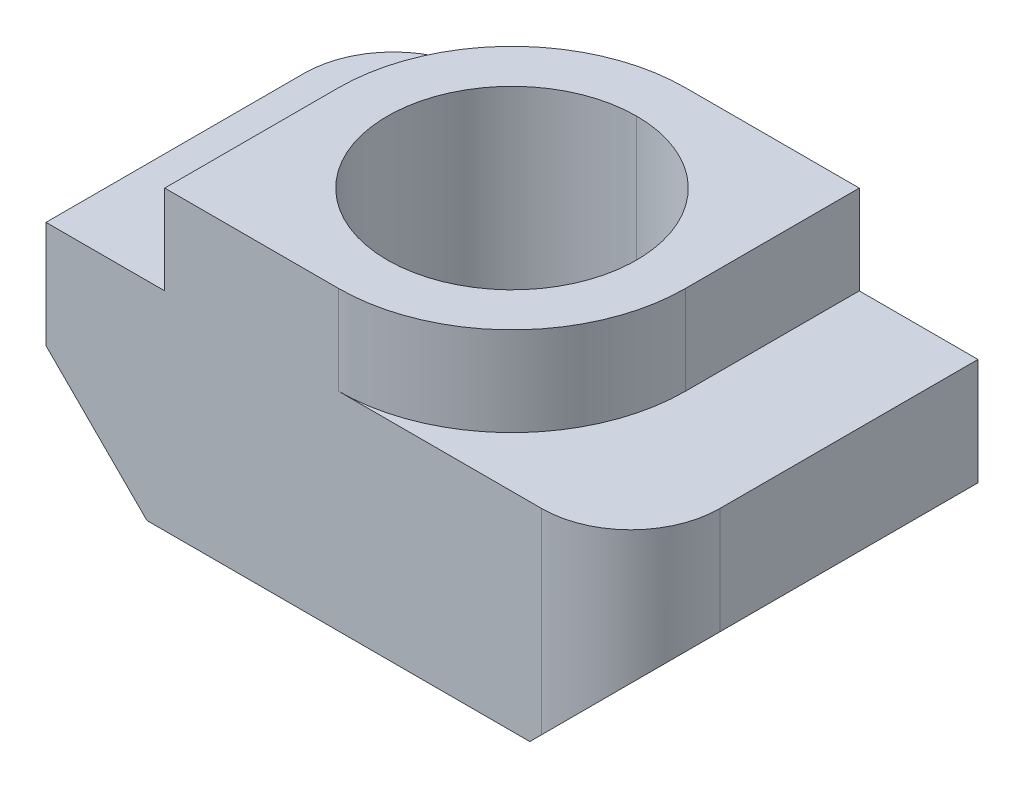
ISO-10303-21;
HEADER;
FILE_DESCRIPTION(('STEP AP214'),'2;1');
FILE_NAME('part.step','',(''),(''),'','','');
FILE_SCHEMA(('AUTOMOTIVE_DESIGN { 1 0 10303 214 1 1 1 1 }'));
ENDSEC;
DATA;
#1=APPLICATION_CONTEXT('core data for automotive mechanical design processes');
#2=APPLICATION_PROTOCOL_DEFINITION('international standard','automotive_design',2000,#1);
#3=PRODUCT_CONTEXT('',#1,'mechanical');
#4=PRODUCT('Part','Part','',(#3));
#5=PRODUCT_RELATED_PRODUCT_CATEGORY('part','',(#4));
#6=PRODUCT_DEFINITION_FORMATION('','',#4);
#7=PRODUCT_DEFINITION_CONTEXT('part definition',#1,'design');
#8=PRODUCT_DEFINITION('design','',#6,#7);
#9=PRODUCT_DEFINITION_SHAPE('','',#8);
#10=(LENGTH_UNIT() NAMED_UNIT(*) SI_UNIT(.MILLI.,.METRE.));
#11=(NAMED_UNIT(*) PLANE_ANGLE_UNIT() SI_UNIT($,.RADIAN.));
#12=(NAMED_UNIT(*) SI_UNIT($,.STERADIAN.) SOLID_ANGLE_UNIT());
#13=UNCERTAINTY_MEASURE_WITH_UNIT(LENGTH_MEASURE(1.E-05),#10,'distance_accuracy_value','');
#14=(GEOMETRIC_REPRESENTATION_CONTEXT(3) GLOBAL_UNCERTAINTY_ASSIGNED_CONTEXT((#13)) GLOBAL_UNIT_ASSIGNED_CONTEXT((#10,
#11,#12)) REPRESENTATION_CONTEXT('',''));
#15=CARTESIAN_POINT('',(0.,0.,0.));
#16=DIRECTION('',(0.,0.,1.));
#17=DIRECTION('',(1.,0.,0.));
#18=AXIS2_PLACEMENT_3D('',#15,#16,#17);
#19=CARTESIAN_POINT('',(3.425,3.5,1.425));
#20=DIRECTION('',(0.,-1.,0.));
#21=DIRECTION('',(0.,0.,-1.));
#22=AXIS2_PLACEMENT_3D('',#19,#20,#21);
#23=CYLINDRICAL_SURFACE('',#22,1.5);
#24=CARTESIAN_POINT('',(3.425,3.5,1.425));
#25=DIRECTION('',(0.,1.,0.));
#26=DIRECTION('',(0.,0.,-1.));
#27=AXIS2_PLACEMENT_3D('',#24,#25,#26);
#28=CIRCLE('',#27,1.5);
#29=CARTESIAN_POINT('',(3.425,3.5,2.925));
#30=VERTEX_POINT('',#29);
#31=CARTESIAN_POINT('',(4.925,3.5,1.425));
#32=VERTEX_POINT('',#31);
#33=EDGE_CURVE('E216',#30,#32,#28,.T.);
#34=ORIENTED_EDGE('',*,*,#33,.F.);
#35=DIRECTION('',(0.,1.,0.));
#36=VECTOR('',#35,1.);
#37=CARTESIAN_POINT('',(3.425,3.5,2.925));
#38=LINE('',#37,#36);
#39=CARTESIAN_POINT('',(3.425,0.200000000000006,2.925));
#40=VERTEX_POINT('',#39);
#41=EDGE_CURVE('E234',#40,#30,#38,.T.);
#42=ORIENTED_EDGE('',*,*,#41,.F.);
#43=CARTESIAN_POINT('',(4.925,1.7,1.425));
#44=CARTESIAN_POINT('',(4.925,1.7,2.30367965644035));
#45=CARTESIAN_POINT('',(4.30367965644036,1.07867965644036,2.925));
#46=CARTESIAN_POINT('',(3.425,0.200000000000006,2.925));
#47=(BOUNDED_CURVE() B_SPLINE_CURVE(3,(#43,#44,#45,#46),.UNSPECIFIED.,.F.,
.F.) B_SPLINE_CURVE_WITH_KNOTS((4,4),(3.1415926535898,4.71238898038469),
.UNSPECIFIED.) CURVE() GEOMETRIC_REPRESENTATION_ITEM() RATIONAL_B_SPLINE_CURVE((1.,
0.804737854124365,0.804737854124365,1.)) REPRESENTATION_ITEM(''));
#48=CARTESIAN_POINT('',(4.925,1.7,1.425));
#49=VERTEX_POINT('',#48);
#50=EDGE_CURVE('E11',#49,#40,#47,.T.);
#51=ORIENTED_EDGE('',*,*,#50,.F.);
#52=DIRECTION('',(0.,-1.,0.));
#53=VECTOR('',#52,1.);
#54=CARTESIAN_POINT('',(4.925,3.5,1.425));
#55=LINE('',#54,#53);
#56=EDGE_CURVE('E253',#32,#49,#55,.T.);
#57=ORIENTED_EDGE('',*,*,#56,.F.);
#58=EDGE_LOOP('',(#34,#42,#51,#57));
#59=FACE_BOUND('',#58,.T.);
#60=ADVANCED_FACE('F17',(#59),#23,.T.);
#61=CARTESIAN_POINT('',(-3.425,3.5,-1.425));
#62=DIRECTION('',(0.,-1.,0.));
#63=DIRECTION('',(0.,0.,-1.));
#64=AXIS2_PLACEMENT_3D('',#61,#62,#63);
#65=CYLINDRICAL_SURFACE('',#64,1.5);
#66=CARTESIAN_POINT('',(-3.425,3.5,-1.425));
#67=DIRECTION('',(0.,1.,0.));
#68=DIRECTION('',(0.,0.,-1.));
#69=AXIS2_PLACEMENT_3D('',#66,#67,#68);
#70=CIRCLE('',#69,1.5);
#71=CARTESIAN_POINT('',(-3.425,3.5,-2.925));
#72=VERTEX_POINT('',#71);
#73=CARTESIAN_POINT('',(-4.925,3.5,-1.425));
#74=VERTEX_POINT('',#73);
#75=EDGE_CURVE('E194',#72,#74,#70,.T.);
#76=ORIENTED_EDGE('',*,*,#75,.F.);
#77=DIRECTION('',(0.,1.,0.));
#78=VECTOR('',#77,1.);
#79=CARTESIAN_POINT('',(-3.425,3.5,-2.925));
#80=LINE('',#79,#78);
#81=CARTESIAN_POINT('',(-3.425,0.200000000000004,-2.925));
#82=VERTEX_POINT('',#81);
#83=EDGE_CURVE('E260',#82,#72,#80,.T.);
#84=ORIENTED_EDGE('',*,*,#83,.F.);
#85=CARTESIAN_POINT('',(-4.925,1.7,-1.425));
#86=CARTESIAN_POINT('',(-4.925,1.7,-2.30367965644035));
#87=CARTESIAN_POINT('',(-4.30367965644036,1.07867965644036,-2.925));
#88=CARTESIAN_POINT('',(-3.425,0.200000000000004,-2.925));
#89=(BOUNDED_CURVE() B_SPLINE_CURVE(3,(#85,#86,#87,#88),.UNSPECIFIED.,.F.,
.F.) B_SPLINE_CURVE_WITH_KNOTS((4,4),(3.1415926535898,4.71238898038469),
.UNSPECIFIED.) CURVE() GEOMETRIC_REPRESENTATION_ITEM() RATIONAL_B_SPLINE_CURVE((1.,
0.804737854124365,0.804737854124365,1.)) REPRESENTATION_ITEM(''));
#90=CARTESIAN_POINT('',(-4.925,1.7,-1.425));
#91=VERTEX_POINT('',#90);
#92=EDGE_CURVE('E28',#91,#82,#89,.T.);
#93=ORIENTED_EDGE('',*,*,#92,.F.);
#94=DIRECTION('',(0.,-1.,0.));
#95=VECTOR('',#94,1.);
#96=CARTESIAN_POINT('',(-4.925,3.5,-1.425));
#97=LINE('',#96,#95);
#98=EDGE_CURVE('E227',#74,#91,#97,.T.);
#99=ORIENTED_EDGE('',*,*,#98,.F.);
#100=EDGE_LOOP('',(#76,#84,#93,#99));
#101=FACE_BOUND('',#100,.T.);
#102=ADVANCED_FACE('F380',(#101),#65,.T.);
#103=CARTESIAN_POINT('',(4.925,1.7,-2.925));
#104=DIRECTION('',(0.707106781186546,-0.707106781186549,0.));
#105=DIRECTION('',(0.,0.,-1.));
#106=AXIS2_PLACEMENT_3D('',#103,#104,#105);
#107=PLANE('',#106);
#108=DIRECTION('',(0.,0.,-1.));
#109=VECTOR('',#108,1.);
#110=CARTESIAN_POINT('',(4.925,1.7,-2.925));
#111=LINE('',#110,#109);
#112=CARTESIAN_POINT('',(4.925,1.7,-2.925));
#113=VERTEX_POINT('',#112);
#114=EDGE_CURVE('E259',#49,#113,#111,.T.);
#115=ORIENTED_EDGE('',*,*,#114,.F.);
#116=ORIENTED_EDGE('',*,*,#50,.T.);
#117=DIRECTION('',(0.707106781186549,0.707106781186546,0.));
#118=VECTOR('',#117,1.);
#119=CARTESIAN_POINT('',(4.925,1.7,2.925));
#120=LINE('',#119,#118);
#121=CARTESIAN_POINT('',(3.225,0.,2.925));
#122=VERTEX_POINT('',#121);
#123=EDGE_CURVE('E177',#122,#40,#120,.T.);
#124=ORIENTED_EDGE('',*,*,#123,.F.);
#125=DIRECTION('',(0.,0.,1.));
#126=VECTOR('',#125,1.);
#127=CARTESIAN_POINT('',(3.225,0.,2.925));
#128=LINE('',#127,#126);
#129=CARTESIAN_POINT('',(3.225,0.,-2.925));
#130=VERTEX_POINT('',#129);
#131=EDGE_CURVE('E286',#130,#122,#128,.T.);
#132=ORIENTED_EDGE('',*,*,#131,.F.);
#133=DIRECTION('',(-0.707106781186549,-0.707106781186546,0.));
#134=VECTOR('',#133,1.);
#135=CARTESIAN_POINT('',(4.925,1.7,-2.925));
#136=LINE('',#135,#134);
#137=EDGE_CURVE('E271',#113,#130,#136,.T.);
#138=ORIENTED_EDGE('',*,*,#137,.F.);
#139=EDGE_LOOP('',(#115,#116,#124,#132,#138));
#140=FACE_BOUND('',#139,.T.);
#141=ADVANCED_FACE('F359',(#140),#107,.T.);
#142=CARTESIAN_POINT('',(-4.925,1.7,-2.925));
#143=DIRECTION('',(-0.707106781186546,-0.707106781186549,0.));
#144=DIRECTION('',(-0.707106781186549,0.707106781186546,0.));
#145=AXIS2_PLACEMENT_3D('',#142,#143,#144);
#146=PLANE('',#145);
#147=DIRECTION('',(0.,0.,1.));
#148=VECTOR('',#147,1.);
#149=CARTESIAN_POINT('',(-4.925,1.7,2.925));
#150=LINE('',#149,#148);
#151=CARTESIAN_POINT('',(-4.925,1.7,2.925));
#152=VERTEX_POINT('',#151);
#153=EDGE_CURVE('E173',#91,#152,#150,.T.);
#154=ORIENTED_EDGE('',*,*,#153,.F.);
#155=ORIENTED_EDGE('',*,*,#92,.T.);
#156=DIRECTION('',(-0.707106781186549,0.707106781186546,0.));
#157=VECTOR('',#156,1.);
#158=CARTESIAN_POINT('',(-4.925,1.7,-2.925));
#159=LINE('',#158,#157);
#160=CARTESIAN_POINT('',(-3.225,0.,-2.925));
#161=VERTEX_POINT('',#160);
#162=EDGE_CURVE('E258',#161,#82,#159,.T.);
#163=ORIENTED_EDGE('',*,*,#162,.F.);
#164=DIRECTION('',(0.,0.,-1.));
#165=VECTOR('',#164,1.);
#166=CARTESIAN_POINT('',(-3.225,0.,-2.925));
#167=LINE('',#166,#165);
#168=CARTESIAN_POINT('',(-3.225,0.,2.925));
#169=VERTEX_POINT('',#168);
#170=EDGE_CURVE('E279',#169,#161,#167,.T.);
#171=ORIENTED_EDGE('',*,*,#170,.F.);
#172=DIRECTION('',(0.707106781186549,-0.707106781186546,0.));
#173=VECTOR('',#172,1.);
#174=CARTESIAN_POINT('',(-4.925,1.7,2.925));
#175=LINE('',#174,#173);
#176=EDGE_CURVE('E246',#152,#169,#175,.T.);
#177=ORIENTED_EDGE('',*,*,#176,.F.);
#178=EDGE_LOOP('',(#154,#155,#163,#171,#177));
#179=FACE_BOUND('',#178,.T.);
#180=ADVANCED_FACE('F378',(#179),#146,.T.);
#181=CARTESIAN_POINT('',(0.,0.,0.));
#182=DIRECTION('',(0.,1.,0.));
#183=DIRECTION('',(0.,0.,1.));
#184=AXIS2_PLACEMENT_3D('',#181,#182,#183);
#185=CYLINDRICAL_SURFACE('',#184,2.1);
#186=DIRECTION('',(0.,1.,0.));
#187=VECTOR('',#186,1.);
#188=CARTESIAN_POINT('',(0.,0.,-2.1));
#189=LINE('',#188,#187);
#190=CARTESIAN_POINT('',(0.,0.,-2.1));
#191=VERTEX_POINT('',#190);
#192=CARTESIAN_POINT('',(0.,5.,-2.1));
#193=VERTEX_POINT('',#192);
#194=EDGE_CURVE('E335',#191,#193,#189,.T.);
#195=ORIENTED_EDGE('',*,*,#194,.F.);
#196=CARTESIAN_POINT('',(0.,0.,0.));
#197=DIRECTION('',(0.,1.,0.));
#198=DIRECTION('',(0.,0.,1.));
#199=AXIS2_PLACEMENT_3D('',#196,#197,#198);
#200=CIRCLE('',#199,2.1);
#201=CARTESIAN_POINT('',(0.,0.,2.1));
#202=VERTEX_POINT('',#201);
#203=EDGE_CURVE('E221',#202,#191,#200,.T.);
#204=ORIENTED_EDGE('',*,*,#203,.F.);
#205=DIRECTION('',(0.,1.,0.));
#206=VECTOR('',#205,1.);
#207=CARTESIAN_POINT('',(0.,0.,2.1));
#208=LINE('',#207,#206);
#209=CARTESIAN_POINT('',(0.,5.,2.1));
#210=VERTEX_POINT('',#209);
#211=EDGE_CURVE('E334',#202,#210,#208,.T.);
#212=ORIENTED_EDGE('',*,*,#211,.T.);
#213=CARTESIAN_POINT('',(0.,5.,0.));
#214=DIRECTION('',(0.,1.,0.));
#215=DIRECTION('',(0.,0.,1.));
#216=AXIS2_PLACEMENT_3D('',#213,#214,#215);
#217=CIRCLE('',#216,2.1);
#218=EDGE_CURVE('E300',#210,#193,#217,.T.);
#219=ORIENTED_EDGE('',*,*,#218,.T.);
#220=EDGE_LOOP('',(#195,#204,#212,#219));
#221=FACE_BOUND('',#220,.T.);
#222=ADVANCED_FACE('F409',(#221),#185,.F.);
#223=CARTESIAN_POINT('',(0.,5.,0.));
#224=DIRECTION('',(0.,1.,0.));
#225=DIRECTION('',(1.,0.,0.));
#226=AXIS2_PLACEMENT_3D('',#223,#224,#225);
#227=PLANE('',#226);
#228=ORIENTED_EDGE('',*,*,#218,.F.);
#229=CARTESIAN_POINT('',(0.,5.,0.));
#230=DIRECTION('',(0.,1.,0.));
#231=DIRECTION('',(0.,0.,1.));
#232=AXIS2_PLACEMENT_3D('',#229,#230,#231);
#233=CIRCLE('',#232,2.1);
#234=EDGE_CURVE('E330',#193,#210,#233,.T.);
#235=ORIENTED_EDGE('',*,*,#234,.F.);
#236=EDGE_LOOP('',(#228,#235));
#237=FACE_BOUND('',#236,.T.);
#238=CARTESIAN_POINT('',(0.,5.,0.));
#239=DIRECTION('',(0.,1.,0.));
#240=DIRECTION('',(0.,0.,1.));
#241=AXIS2_PLACEMENT_3D('',#238,#239,#240);
#242=CIRCLE('',#241,2.925);
#243=CARTESIAN_POINT('',(0.,5.,2.925));
#244=VERTEX_POINT('',#243);
#245=CARTESIAN_POINT('',(2.925,5.,0.));
#246=VERTEX_POINT('',#245);
#247=EDGE_CURVE('E220',#244,#246,#242,.T.);
#248=ORIENTED_EDGE('',*,*,#247,.T.);
#249=DIRECTION('',(0.,0.,-1.));
#250=VECTOR('',#249,1.);
#251=CARTESIAN_POINT('',(2.925,5.,0.));
#252=LINE('',#251,#250);
#253=CARTESIAN_POINT('',(2.925,5.,-2.925));
#254=VERTEX_POINT('',#253);
#255=EDGE_CURVE('E283',#246,#254,#252,.T.);
#256=ORIENTED_EDGE('',*,*,#255,.T.);
#257=DIRECTION('',(-1.,0.,0.));
#258=VECTOR('',#257,1.);
#259=CARTESIAN_POINT('',(2.925,5.,-2.925));
#260=LINE('',#259,#258);
#261=CARTESIAN_POINT('',(0.,5.,-2.925));
#262=VERTEX_POINT('',#261);
#263=EDGE_CURVE('E264',#254,#262,#260,.T.);
#264=ORIENTED_EDGE('',*,*,#263,.T.);
#265=CARTESIAN_POINT('',(0.,5.,0.));
#266=DIRECTION('',(0.,1.,0.));
#267=DIRECTION('',(0.,0.,1.));
#268=AXIS2_PLACEMENT_3D('',#265,#266,#267);
#269=CIRCLE('',#268,2.925);
#270=CARTESIAN_POINT('',(-2.925,5.,0.));
#271=VERTEX_POINT('',#270);
#272=EDGE_CURVE('E296',#262,#271,#269,.T.);
#273=ORIENTED_EDGE('',*,*,#272,.T.);
#274=DIRECTION('',(0.,0.,1.));
#275=VECTOR('',#274,1.);
#276=CARTESIAN_POINT('',(-2.925,5.,0.));
#277=LINE('',#276,#275);
#278=CARTESIAN_POINT('',(-2.925,5.,2.925));
#279=VERTEX_POINT('',#278);
#280=EDGE_CURVE('E41',#271,#279,#277,.T.);
#281=ORIENTED_EDGE('',*,*,#280,.T.);
#282=DIRECTION('',(1.,0.,0.));
#283=VECTOR('',#282,1.);
#284=CARTESIAN_POINT('',(-2.925,5.,2.925));
#285=LINE('',#284,#283);
#286=EDGE_CURVE('E240',#279,#244,#285,.T.);
#287=ORIENTED_EDGE('',*,*,#286,.T.);
#288=EDGE_LOOP('',(#248,#256,#264,#273,#281,#287));
#289=FACE_BOUND('',#288,.T.);
#290=ADVANCED_FACE('F388',(#237,#289),#227,.T.);
#291=CARTESIAN_POINT('',(-2.925,5.,0.));
#292=DIRECTION('',(1.,0.,0.));
#293=DIRECTION('',(0.,1.,0.));
#294=AXIS2_PLACEMENT_3D('',#291,#292,#293);
#295=PLANE('',#294);
#296=DIRECTION('',(0.,0.,1.));
#297=VECTOR('',#296,1.);
#298=CARTESIAN_POINT('',(-2.925,3.5,0.));
#299=LINE('',#298,#297);
#300=CARTESIAN_POINT('',(-2.925,3.5,0.));
#301=VERTEX_POINT('',#300);
#302=CARTESIAN_POINT('',(-2.925,3.5,2.925));
#303=VERTEX_POINT('',#302);
#304=EDGE_CURVE('E189',#301,#303,#299,.T.);
#305=ORIENTED_EDGE('',*,*,#304,.T.);
#306=DIRECTION('',(0.,-1.,0.));
#307=VECTOR('',#306,1.);
#308=CARTESIAN_POINT('',(-2.925,5.,2.925));
#309=LINE('',#308,#307);
#310=EDGE_CURVE('E184',#279,#303,#309,.T.);
#311=ORIENTED_EDGE('',*,*,#310,.F.);
#312=ORIENTED_EDGE('',*,*,#280,.F.);
#313=DIRECTION('',(0.,-1.,0.));
#314=VECTOR('',#313,1.);
#315=CARTESIAN_POINT('',(-2.925,5.,0.));
#316=LINE('',#315,#314);
#317=EDGE_CURVE('E293',#271,#301,#316,.T.);
#318=ORIENTED_EDGE('',*,*,#317,.T.);
#319=EDGE_LOOP('',(#305,#311,#312,#318));
#320=FACE_BOUND('',#319,.T.);
#321=ADVANCED_FACE('F400',(#320),#295,.F.);
#322=CARTESIAN_POINT('',(0.,5.,0.));
#323=DIRECTION('',(0.,-1.,0.));
#324=DIRECTION('',(0.,0.,-1.));
#325=AXIS2_PLACEMENT_3D('',#322,#323,#324);
#326=CYLINDRICAL_SURFACE('',#325,2.925);
#327=CARTESIAN_POINT('',(0.,3.5,0.));
#328=DIRECTION('',(0.,1.,0.));
#329=DIRECTION('',(0.,0.,1.));
#330=AXIS2_PLACEMENT_3D('',#327,#328,#329);
#331=CIRCLE('',#330,2.925);
#332=CARTESIAN_POINT('',(0.,3.5,-2.925));
#333=VERTEX_POINT('',#332);
#334=EDGE_CURVE('E208',#333,#301,#331,.T.);
#335=ORIENTED_EDGE('',*,*,#334,.T.);
#336=ORIENTED_EDGE('',*,*,#317,.F.);
#337=ORIENTED_EDGE('',*,*,#272,.F.);
#338=DIRECTION('',(0.,-1.,0.));
#339=VECTOR('',#338,1.);
#340=CARTESIAN_POINT('',(0.,5.,-2.925));
#341=LINE('',#340,#339);
#342=EDGE_CURVE('E263',#262,#333,#341,.T.);
#343=ORIENTED_EDGE('',*,*,#342,.T.);
#344=EDGE_LOOP('',(#335,#336,#337,#343));
#345=FACE_BOUND('',#344,.T.);
#346=ADVANCED_FACE('F386',(#345),#326,.T.);
#347=CARTESIAN_POINT('',(2.925,5.,0.));
#348=DIRECTION('',(-1.,0.,0.));
#349=DIRECTION('',(0.,0.,1.));
#350=AXIS2_PLACEMENT_3D('',#347,#348,#349);
#351=PLANE('',#350);
#352=DIRECTION('',(0.,0.,-1.));
#353=VECTOR('',#352,1.);
#354=CARTESIAN_POINT('',(2.925,3.5,0.));
#355=LINE('',#354,#353);
#356=CARTESIAN_POINT('',(2.925,3.5,0.));
#357=VERTEX_POINT('',#356);
#358=CARTESIAN_POINT('',(2.925,3.5,-2.925));
#359=VERTEX_POINT('',#358);
#360=EDGE_CURVE('E322',#357,#359,#355,.T.);
#361=ORIENTED_EDGE('',*,*,#360,.T.);
#362=DIRECTION('',(0.,-1.,0.));
#363=VECTOR('',#362,1.);
#364=CARTESIAN_POINT('',(2.925,5.,-2.925));
#365=LINE('',#364,#363);
#366=EDGE_CURVE('E268',#254,#359,#365,.T.);
#367=ORIENTED_EDGE('',*,*,#366,.F.);
#368=ORIENTED_EDGE('',*,*,#255,.F.);
#369=DIRECTION('',(0.,-1.,0.));
#370=VECTOR('',#369,1.);
#371=CARTESIAN_POINT('',(2.925,5.,0.));
#372=LINE('',#371,#370);
#373=EDGE_CURVE('E217',#246,#357,#372,.T.);
#374=ORIENTED_EDGE('',*,*,#373,.T.);
#375=EDGE_LOOP('',(#361,#367,#368,#374));
#376=FACE_BOUND('',#375,.T.);
#377=ADVANCED_FACE('F391',(#376),#351,.F.);
#378=CARTESIAN_POINT('',(0.,5.,0.));
#379=DIRECTION('',(0.,-1.,0.));
#380=DIRECTION('',(0.,0.,-1.));
#381=AXIS2_PLACEMENT_3D('',#378,#379,#380);
#382=CYLINDRICAL_SURFACE('',#381,2.925);
#383=CARTESIAN_POINT('',(0.,3.5,0.));
#384=DIRECTION('',(0.,1.,0.));
#385=DIRECTION('',(0.,0.,1.));
#386=AXIS2_PLACEMENT_3D('',#383,#384,#385);
#387=CIRCLE('',#386,2.925);
#388=CARTESIAN_POINT('',(0.,3.5,2.925));
#389=VERTEX_POINT('',#388);
#390=EDGE_CURVE('E205',#389,#357,#387,.T.);
#391=ORIENTED_EDGE('',*,*,#390,.T.);
#392=ORIENTED_EDGE('',*,*,#373,.F.);
#393=ORIENTED_EDGE('',*,*,#247,.F.);
#394=DIRECTION('',(0.,-1.,0.));
#395=VECTOR('',#394,1.);
#396=CARTESIAN_POINT('',(0.,5.,2.925));
#397=LINE('',#396,#395);
#398=EDGE_CURVE('E237',#244,#389,#397,.T.);
#399=ORIENTED_EDGE('',*,*,#398,.T.);
#400=EDGE_LOOP('',(#391,#392,#393,#399));
#401=FACE_BOUND('',#400,.T.);
#402=ADVANCED_FACE('F399',(#401),#382,.T.);
#403=CARTESIAN_POINT('',(0.,0.,0.));
#404=DIRECTION('',(0.,-1.,0.));
#405=DIRECTION('',(0.,0.,-1.));
#406=AXIS2_PLACEMENT_3D('',#403,#404,#405);
#407=PLANE('',#406);
#408=ORIENTED_EDGE('',*,*,#203,.T.);
#409=CARTESIAN_POINT('',(0.,0.,0.));
#410=DIRECTION('',(0.,1.,0.));
#411=DIRECTION('',(0.,0.,1.));
#412=AXIS2_PLACEMENT_3D('',#409,#410,#411);
#413=CIRCLE('',#412,2.1);
#414=EDGE_CURVE('E450',#191,#202,#413,.T.);
#415=ORIENTED_EDGE('',*,*,#414,.T.);
#416=EDGE_LOOP('',(#408,#415));
#417=FACE_BOUND('',#416,.T.);
#418=DIRECTION('',(1.,0.,0.));
#419=VECTOR('',#418,1.);
#420=CARTESIAN_POINT('',(4.925,0.,2.925));
#421=LINE('',#420,#419);
#422=EDGE_CURVE('E249',#169,#122,#421,.T.);
#423=ORIENTED_EDGE('',*,*,#422,.F.);
#424=ORIENTED_EDGE('',*,*,#170,.T.);
#425=DIRECTION('',(-1.,0.,0.));
#426=VECTOR('',#425,1.);
#427=CARTESIAN_POINT('',(4.925,0.,-2.925));
#428=LINE('',#427,#426);
#429=EDGE_CURVE('E275',#130,#161,#428,.T.);
#430=ORIENTED_EDGE('',*,*,#429,.F.);
#431=ORIENTED_EDGE('',*,*,#131,.T.);
#432=EDGE_LOOP('',(#423,#424,#430,#431));
#433=FACE_BOUND('',#432,.T.);
#434=ADVANCED_FACE('F377',(#417,#433),#407,.T.);
#435=CARTESIAN_POINT('',(4.925,3.5,-2.925));
#436=DIRECTION('',(0.,0.,1.));
#437=DIRECTION('',(1.,0.,0.));
#438=AXIS2_PLACEMENT_3D('',#435,#436,#437);
#439=PLANE('',#438);
#440=ORIENTED_EDGE('',*,*,#162,.T.);
#441=ORIENTED_EDGE('',*,*,#83,.T.);
#442=DIRECTION('',(-1.,0.,0.));
#443=VECTOR('',#442,1.);
#444=CARTESIAN_POINT('',(4.925,3.5,-2.925));
#445=LINE('',#444,#443);
#446=EDGE_CURVE('E201',#333,#72,#445,.T.);
#447=ORIENTED_EDGE('',*,*,#446,.F.);
#448=ORIENTED_EDGE('',*,*,#342,.F.);
#449=ORIENTED_EDGE('',*,*,#263,.F.);
#450=ORIENTED_EDGE('',*,*,#366,.T.);
#451=DIRECTION('',(-1.,0.,0.));
#452=VECTOR('',#451,1.);
#453=CARTESIAN_POINT('',(4.925,3.5,-2.925));
#454=LINE('',#453,#452);
#455=CARTESIAN_POINT('',(4.925,3.5,-2.925));
#456=VERTEX_POINT('',#455);
#457=EDGE_CURVE('E226',#456,#359,#454,.T.);
#458=ORIENTED_EDGE('',*,*,#457,.F.);
#459=DIRECTION('',(0.,-1.,0.));
#460=VECTOR('',#459,1.);
#461=CARTESIAN_POINT('',(4.925,3.5,-2.925));
#462=LINE('',#461,#460);
#463=EDGE_CURVE('E254',#456,#113,#462,.T.);
#464=ORIENTED_EDGE('',*,*,#463,.T.);
#465=ORIENTED_EDGE('',*,*,#137,.T.);
#466=ORIENTED_EDGE('',*,*,#429,.T.);
#467=EDGE_LOOP('',(#440,#441,#447,#448,#449,#450,#458,#464,#465,#466));
#468=FACE_BOUND('',#467,.T.);
#469=ADVANCED_FACE('F364',(#468),#439,.F.);
#470=CARTESIAN_POINT('',(4.925,3.5,-2.925));
#471=DIRECTION('',(-1.,0.,0.));
#472=DIRECTION('',(0.,1.,0.));
#473=AXIS2_PLACEMENT_3D('',#470,#471,#472);
#474=PLANE('',#473);
#475=DIRECTION('',(0.,0.,-1.));
#476=VECTOR('',#475,1.);
#477=CARTESIAN_POINT('',(4.925,3.5,-2.925));
#478=LINE('',#477,#476);
#479=EDGE_CURVE('E222',#32,#456,#478,.T.);
#480=ORIENTED_EDGE('',*,*,#479,.F.);
#481=ORIENTED_EDGE('',*,*,#56,.T.);
#482=ORIENTED_EDGE('',*,*,#114,.T.);
#483=ORIENTED_EDGE('',*,*,#463,.F.);
#484=EDGE_LOOP('',(#480,#481,#482,#483));
#485=FACE_BOUND('',#484,.T.);
#486=ADVANCED_FACE('F352',(#485),#474,.F.);
#487=CARTESIAN_POINT('',(4.925,3.5,2.925));
#488=DIRECTION('',(0.,0.,-1.));
#489=DIRECTION('',(-1.,0.,0.));
#490=AXIS2_PLACEMENT_3D('',#487,#488,#489);
#491=PLANE('',#490);
#492=ORIENTED_EDGE('',*,*,#123,.T.);
#493=ORIENTED_EDGE('',*,*,#41,.T.);
#494=DIRECTION('',(1.,0.,0.));
#495=VECTOR('',#494,1.);
#496=CARTESIAN_POINT('',(4.925,3.5,2.925));
#497=LINE('',#496,#495);
#498=EDGE_CURVE('E212',#389,#30,#497,.T.);
#499=ORIENTED_EDGE('',*,*,#498,.F.);
#500=ORIENTED_EDGE('',*,*,#398,.F.);
#501=ORIENTED_EDGE('',*,*,#286,.F.);
#502=ORIENTED_EDGE('',*,*,#310,.T.);
#503=DIRECTION('',(1.,0.,0.));
#504=VECTOR('',#503,1.);
#505=CARTESIAN_POINT('',(4.925,3.5,2.925));
#506=LINE('',#505,#504);
#507=CARTESIAN_POINT('',(-4.925,3.5,2.925));
#508=VERTEX_POINT('',#507);
#509=EDGE_CURVE('E180',#508,#303,#506,.T.);
#510=ORIENTED_EDGE('',*,*,#509,.F.);
#511=DIRECTION('',(0.,-1.,0.));
#512=VECTOR('',#511,1.);
#513=CARTESIAN_POINT('',(-4.925,3.5,2.925));
#514=LINE('',#513,#512);
#515=EDGE_CURVE('E165',#508,#152,#514,.T.);
#516=ORIENTED_EDGE('',*,*,#515,.T.);
#517=ORIENTED_EDGE('',*,*,#176,.T.);
#518=ORIENTED_EDGE('',*,*,#422,.T.);
#519=EDGE_LOOP('',(#492,#493,#499,#500,#501,#502,#510,#516,#517,#518));
#520=FACE_BOUND('',#519,.T.);
#521=ADVANCED_FACE('F182',(#520),#491,.F.);
#522=CARTESIAN_POINT('',(-4.925,3.5,-2.925));
#523=DIRECTION('',(1.,0.,0.));
#524=DIRECTION('',(0.,0.,-1.));
#525=AXIS2_PLACEMENT_3D('',#522,#523,#524);
#526=PLANE('',#525);
#527=DIRECTION('',(0.,0.,1.));
#528=VECTOR('',#527,1.);
#529=CARTESIAN_POINT('',(-4.925,3.5,-2.925));
#530=LINE('',#529,#528);
#531=EDGE_CURVE('E170',#74,#508,#530,.T.);
#532=ORIENTED_EDGE('',*,*,#531,.F.);
#533=ORIENTED_EDGE('',*,*,#98,.T.);
#534=ORIENTED_EDGE('',*,*,#153,.T.);
#535=ORIENTED_EDGE('',*,*,#515,.F.);
#536=EDGE_LOOP('',(#532,#533,#534,#535));
#537=FACE_BOUND('',#536,.T.);
#538=ADVANCED_FACE('F167',(#537),#526,.F.);
#539=CARTESIAN_POINT('',(0.,3.5,0.));
#540=DIRECTION('',(0.,-1.,0.));
#541=DIRECTION('',(0.,0.,-1.));
#542=AXIS2_PLACEMENT_3D('',#539,#540,#541);
#543=PLANE('',#542);
#544=ORIENTED_EDGE('',*,*,#498,.T.);
#545=ORIENTED_EDGE('',*,*,#33,.T.);
#546=ORIENTED_EDGE('',*,*,#479,.T.);
#547=ORIENTED_EDGE('',*,*,#457,.T.);
#548=ORIENTED_EDGE('',*,*,#360,.F.);
#549=ORIENTED_EDGE('',*,*,#390,.F.);
#550=EDGE_LOOP('',(#544,#545,#546,#547,#548,#549));
#551=FACE_BOUND('',#550,.T.);
#552=ADVANCED_FACE('F370',(#551),#543,.F.);
#553=CARTESIAN_POINT('',(0.,3.5,0.));
#554=DIRECTION('',(0.,-1.,0.));
#555=DIRECTION('',(0.,0.,-1.));
#556=AXIS2_PLACEMENT_3D('',#553,#554,#555);
#557=PLANE('',#556);
#558=ORIENTED_EDGE('',*,*,#446,.T.);
#559=ORIENTED_EDGE('',*,*,#75,.T.);
#560=ORIENTED_EDGE('',*,*,#531,.T.);
#561=ORIENTED_EDGE('',*,*,#509,.T.);
#562=ORIENTED_EDGE('',*,*,#304,.F.);
#563=ORIENTED_EDGE('',*,*,#334,.F.);
#564=EDGE_LOOP('',(#558,#559,#560,#561,#562,#563));
#565=FACE_BOUND('',#564,.T.);
#566=ADVANCED_FACE('F192',(#565),#557,.F.);
#567=CARTESIAN_POINT('',(0.,0.,0.));
#568=DIRECTION('',(0.,1.,0.));
#569=DIRECTION('',(0.,0.,1.));
#570=AXIS2_PLACEMENT_3D('',#567,#568,#569);
#571=CYLINDRICAL_SURFACE('',#570,2.1);
#572=ORIENTED_EDGE('',*,*,#414,.F.);
#573=ORIENTED_EDGE('',*,*,#194,.T.);
#574=ORIENTED_EDGE('',*,*,#234,.T.);
#575=ORIENTED_EDGE('',*,*,#211,.F.);
#576=EDGE_LOOP('',(#572,#573,#574,#575));
#577=FACE_BOUND('',#576,.T.);
#578=ADVANCED_FACE('F426',(#577),#571,.F.);
#579=CLOSED_SHELL('',(#60,#102,#141,#180,#222,#290,#321,#346,#377,#402,#434,#469,#486,#521,#538,
#552,#566,#578));
#580=MANIFOLD_SOLID_BREP('B1',#579);
#581=ADVANCED_BREP_SHAPE_REPRESENTATION('',(#18,#580),#14);
#582=SHAPE_DEFINITION_REPRESENTATION(#9,#581);
ENDSEC;
END-ISO-10303-21;
